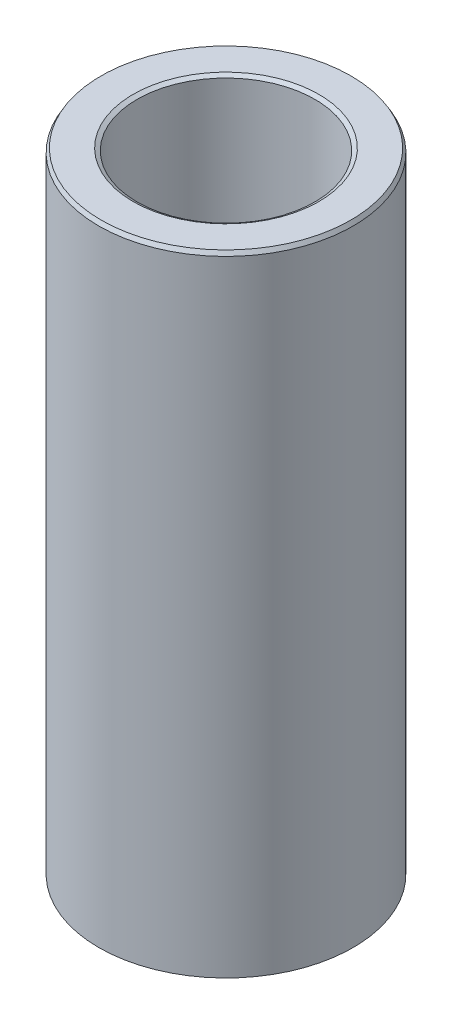
ISO-10303-21;
HEADER;
FILE_DESCRIPTION(('STEP AP214'),'2;1');
FILE_NAME('part.step','',(''),(''),'','','');
FILE_SCHEMA(('AUTOMOTIVE_DESIGN { 1 0 10303 214 1 1 1 1 }'));
ENDSEC;
DATA;
#1=APPLICATION_CONTEXT('core data for automotive mechanical design processes');
#2=APPLICATION_PROTOCOL_DEFINITION('international standard','automotive_design',2000,#1);
#3=PRODUCT_CONTEXT('',#1,'mechanical');
#4=PRODUCT('Part','Part','',(#3));
#5=PRODUCT_RELATED_PRODUCT_CATEGORY('part','',(#4));
#6=PRODUCT_DEFINITION_FORMATION('','',#4);
#7=PRODUCT_DEFINITION_CONTEXT('part definition',#1,'design');
#8=PRODUCT_DEFINITION('design','',#6,#7);
#9=PRODUCT_DEFINITION_SHAPE('','',#8);
#10=(LENGTH_UNIT() NAMED_UNIT(*) SI_UNIT(.MILLI.,.METRE.));
#11=(NAMED_UNIT(*) PLANE_ANGLE_UNIT() SI_UNIT($,.RADIAN.));
#12=(NAMED_UNIT(*) SI_UNIT($,.STERADIAN.) SOLID_ANGLE_UNIT());
#13=UNCERTAINTY_MEASURE_WITH_UNIT(LENGTH_MEASURE(1.E-05),#10,'distance_accuracy_value','');
#14=(GEOMETRIC_REPRESENTATION_CONTEXT(3) GLOBAL_UNCERTAINTY_ASSIGNED_CONTEXT((#13)) GLOBAL_UNIT_ASSIGNED_CONTEXT((#10,
#11,#12)) REPRESENTATION_CONTEXT('',''));
#15=CARTESIAN_POINT('',(0.,0.,0.));
#16=DIRECTION('',(0.,0.,1.));
#17=DIRECTION('',(1.,0.,0.));
#18=AXIS2_PLACEMENT_3D('',#15,#16,#17);
#19=CARTESIAN_POINT('',(0.,86.8304050016824,0.));
#20=DIRECTION('',(0.,-1.,0.));
#21=DIRECTION('',(0.,0.,-1.));
#22=AXIS2_PLACEMENT_3D('',#19,#20,#21);
#23=CYLINDRICAL_SURFACE('',#22,17.5);
#24=CARTESIAN_POINT('',(0.,0.317162728336817,0.));
#25=DIRECTION('',(0.,1.,0.));
#26=DIRECTION('',(0.,0.,1.));
#27=AXIS2_PLACEMENT_3D('',#24,#25,#26);
#28=CIRCLE('',#27,17.5);
#29=CARTESIAN_POINT('',(0.,0.317162728336817,17.5));
#30=VERTEX_POINT('',#29);
#31=EDGE_CURVE('E10',#30,#30,#28,.T.);
#32=ORIENTED_EDGE('',*,*,#31,.T.);
#33=EDGE_LOOP('',(#32));
#34=FACE_BOUND('',#33,.T.);
#35=CARTESIAN_POINT('',(0.,86.2810630419358,0.));
#36=DIRECTION('',(0.,1.,0.));
#37=DIRECTION('',(0.,0.,1.));
#38=AXIS2_PLACEMENT_3D('',#35,#36,#37);
#39=CIRCLE('',#38,17.5);
#40=CARTESIAN_POINT('',(0.,86.2810630419358,17.5));
#41=VERTEX_POINT('',#40);
#42=EDGE_CURVE('E50',#41,#41,#39,.F.);
#43=ORIENTED_EDGE('',*,*,#42,.T.);
#44=EDGE_LOOP('',(#43));
#45=FACE_BOUND('',#44,.T.);
#46=ADVANCED_FACE('F39',(#34,#45),#23,.T.);
#47=CARTESIAN_POINT('',(0.,86.8304050016824,0.));
#48=DIRECTION('',(0.,1.,0.));
#49=DIRECTION('',(0.,0.,1.));
#50=AXIS2_PLACEMENT_3D('',#47,#48,#49);
#51=PLANE('',#50);
#52=CARTESIAN_POINT('',(0.,86.8304050016824,0.));
#53=DIRECTION('',(0.,1.,0.));
#54=DIRECTION('',(0.,0.,1.));
#55=AXIS2_PLACEMENT_3D('',#52,#53,#54);
#56=CIRCLE('',#55,12.7813403702485);
#57=CARTESIAN_POINT('',(0.,86.8304050016824,12.7813403702485));
#58=VERTEX_POINT('',#57);
#59=EDGE_CURVE('E58',#58,#58,#56,.F.);
#60=ORIENTED_EDGE('',*,*,#59,.T.);
#61=EDGE_LOOP('',(#60));
#62=FACE_BOUND('',#61,.T.);
#63=CARTESIAN_POINT('',(0.,86.8304050016824,0.));
#64=DIRECTION('',(0.,1.,0.));
#65=DIRECTION('',(0.,0.,1.));
#66=AXIS2_PLACEMENT_3D('',#63,#64,#65);
#67=CIRCLE('',#66,17.1828372716632);
#68=CARTESIAN_POINT('',(0.,86.8304050016824,17.1828372716632));
#69=VERTEX_POINT('',#68);
#70=EDGE_CURVE('E61',#69,#69,#67,.T.);
#71=ORIENTED_EDGE('',*,*,#70,.T.);
#72=EDGE_LOOP('',(#71));
#73=FACE_BOUND('',#72,.T.);
#74=ADVANCED_FACE('F88',(#62,#73),#51,.T.);
#75=CARTESIAN_POINT('',(0.,0.,0.));
#76=DIRECTION('',(0.,1.,0.));
#77=DIRECTION('',(0.,0.,1.));
#78=AXIS2_PLACEMENT_3D('',#75,#76,#77);
#79=PLANE('',#78);
#80=CARTESIAN_POINT('',(0.,0.,0.));
#81=DIRECTION('',(0.,1.,0.));
#82=DIRECTION('',(0.,0.,1.));
#83=AXIS2_PLACEMENT_3D('',#80,#81,#82);
#84=CIRCLE('',#83,12.5491611388388);
#85=CARTESIAN_POINT('',(0.,0.,12.5491611388388));
#86=VERTEX_POINT('',#85);
#87=EDGE_CURVE('E51',#86,#86,#84,.T.);
#88=ORIENTED_EDGE('',*,*,#87,.T.);
#89=EDGE_LOOP('',(#88));
#90=FACE_BOUND('',#89,.T.);
#91=CARTESIAN_POINT('',(0.,0.,0.));
#92=DIRECTION('',(0.,1.,0.));
#93=DIRECTION('',(0.,0.,1.));
#94=AXIS2_PLACEMENT_3D('',#91,#92,#93);
#95=CIRCLE('',#94,16.9506580402535);
#96=CARTESIAN_POINT('',(0.,0.,16.9506580402535));
#97=VERTEX_POINT('',#96);
#98=EDGE_CURVE('E54',#97,#97,#95,.F.);
#99=ORIENTED_EDGE('',*,*,#98,.T.);
#100=EDGE_LOOP('',(#99));
#101=FACE_BOUND('',#100,.T.);
#102=ADVANCED_FACE('F83',(#90,#101),#79,.F.);
#103=CARTESIAN_POINT('',(0.,86.8304050016824,0.));
#104=DIRECTION('',(0.,-1.,0.));
#105=DIRECTION('',(0.,0.,-1.));
#106=AXIS2_PLACEMENT_3D('',#103,#104,#105);
#107=CYLINDRICAL_SURFACE('',#106,12.231998410502);
#108=CARTESIAN_POINT('',(0.,86.5132422733455,0.));
#109=DIRECTION('',(0.,1.,0.));
#110=DIRECTION('',(0.,0.,1.));
#111=AXIS2_PLACEMENT_3D('',#108,#109,#110);
#112=CIRCLE('',#111,12.231998410502);
#113=CARTESIAN_POINT('',(0.,86.5132422733455,12.231998410502));
#114=VERTEX_POINT('',#113);
#115=EDGE_CURVE('E67',#114,#114,#112,.T.);
#116=ORIENTED_EDGE('',*,*,#115,.T.);
#117=EDGE_LOOP('',(#116));
#118=FACE_BOUND('',#117,.T.);
#119=CARTESIAN_POINT('',(0.,0.549341959746583,0.));
#120=DIRECTION('',(0.,1.,0.));
#121=DIRECTION('',(0.,0.,1.));
#122=AXIS2_PLACEMENT_3D('',#119,#120,#121);
#123=CIRCLE('',#122,12.231998410502);
#124=CARTESIAN_POINT('',(0.,0.549341959746583,12.231998410502));
#125=VERTEX_POINT('',#124);
#126=EDGE_CURVE('E69',#125,#125,#123,.F.);
#127=ORIENTED_EDGE('',*,*,#126,.T.);
#128=EDGE_LOOP('',(#127));
#129=FACE_BOUND('',#128,.T.);
#130=ADVANCED_FACE('F71',(#118,#129),#107,.F.);
#131=CARTESIAN_POINT('',(0.,86.5132422733455,0.));
#132=DIRECTION('',(0.,1.,0.));
#133=DIRECTION('',(0.,0.,1.));
#134=AXIS2_PLACEMENT_3D('',#131,#132,#133);
#135=CONICAL_SURFACE('',#134,12.231998410502,1.04719755119659);
#136=ORIENTED_EDGE('',*,*,#59,.F.);
#137=EDGE_LOOP('',(#136));
#138=FACE_BOUND('',#137,.T.);
#139=ORIENTED_EDGE('',*,*,#115,.F.);
#140=EDGE_LOOP('',(#139));
#141=FACE_BOUND('',#140,.T.);
#142=ADVANCED_FACE('F77',(#138,#141),#135,.F.);
#143=CARTESIAN_POINT('',(0.,0.,0.));
#144=DIRECTION('',(0.,-1.,0.));
#145=DIRECTION('',(0.,0.,-1.));
#146=AXIS2_PLACEMENT_3D('',#143,#144,#145);
#147=CONICAL_SURFACE('',#146,12.5491611388388,0.523598775598293);
#148=ORIENTED_EDGE('',*,*,#126,.F.);
#149=EDGE_LOOP('',(#148));
#150=FACE_BOUND('',#149,.T.);
#151=ORIENTED_EDGE('',*,*,#87,.F.);
#152=EDGE_LOOP('',(#151));
#153=FACE_BOUND('',#152,.T.);
#154=ADVANCED_FACE('F73',(#150,#153),#147,.F.);
#155=CARTESIAN_POINT('',(0.,0.317162728336817,0.));
#156=DIRECTION('',(0.,1.,0.));
#157=DIRECTION('',(0.,0.,1.));
#158=AXIS2_PLACEMENT_3D('',#155,#156,#157);
#159=CONICAL_SURFACE('',#158,17.5,1.04719755119661);
#160=ORIENTED_EDGE('',*,*,#98,.F.);
#161=EDGE_LOOP('',(#160));
#162=FACE_BOUND('',#161,.T.);
#163=ORIENTED_EDGE('',*,*,#31,.F.);
#164=EDGE_LOOP('',(#163));
#165=FACE_BOUND('',#164,.T.);
#166=ADVANCED_FACE('F76',(#162,#165),#159,.T.);
#167=CARTESIAN_POINT('',(0.,86.8304050016824,0.));
#168=DIRECTION('',(0.,-1.,0.));
#169=DIRECTION('',(0.,0.,-1.));
#170=AXIS2_PLACEMENT_3D('',#167,#168,#169);
#171=CONICAL_SURFACE('',#170,17.1828372716632,0.523598775598299);
#172=ORIENTED_EDGE('',*,*,#42,.F.);
#173=EDGE_LOOP('',(#172));
#174=FACE_BOUND('',#173,.T.);
#175=ORIENTED_EDGE('',*,*,#70,.F.);
#176=EDGE_LOOP('',(#175));
#177=FACE_BOUND('',#176,.T.);
#178=ADVANCED_FACE('F45',(#174,#177),#171,.T.);
#179=CLOSED_SHELL('',(#46,#74,#102,#130,#142,#154,#166,#178));
#180=MANIFOLD_SOLID_BREP('B2',#179);
#181=ADVANCED_BREP_SHAPE_REPRESENTATION('',(#18,#180),#14);
#182=SHAPE_DEFINITION_REPRESENTATION(#9,#181);
ENDSEC;
END-ISO-10303-21;
